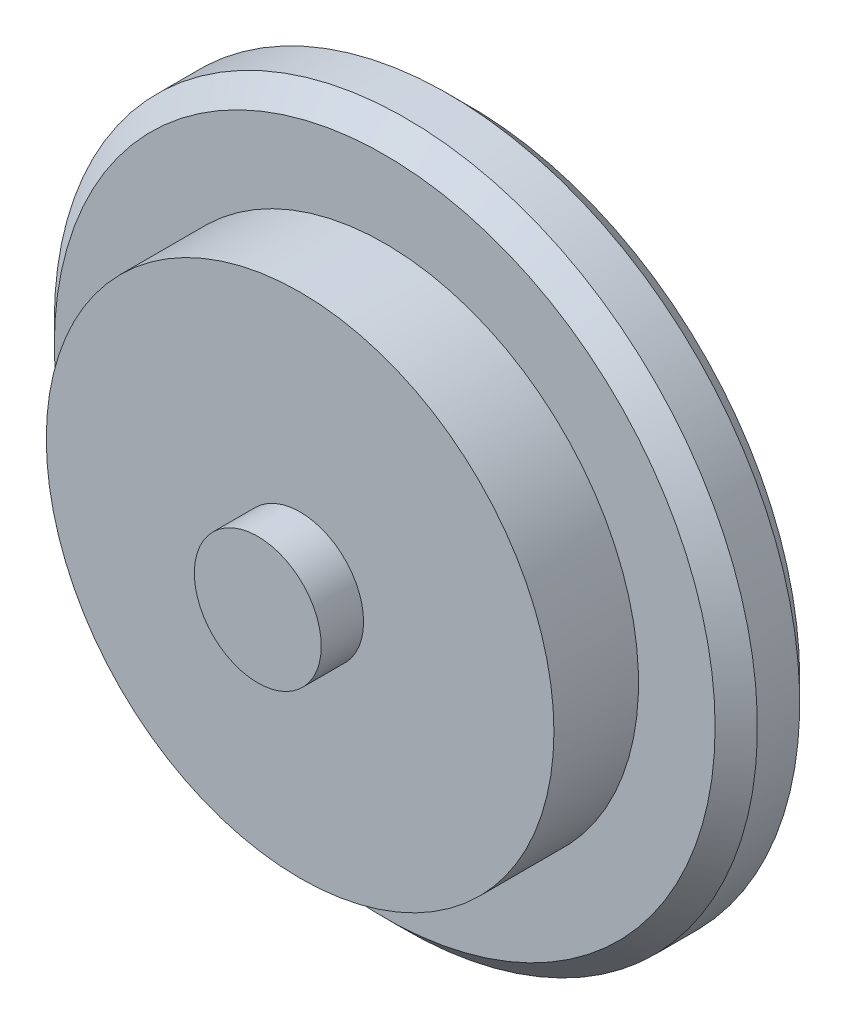
ISO-10303-21;
HEADER;
FILE_DESCRIPTION(('STEP AP214'),'2;1');
FILE_NAME('part.step','',(''),(''),'','','');
FILE_SCHEMA(('AUTOMOTIVE_DESIGN { 1 0 10303 214 1 1 1 1 }'));
ENDSEC;
DATA;
#1=APPLICATION_CONTEXT('core data for automotive mechanical design processes');
#2=APPLICATION_PROTOCOL_DEFINITION('international standard','automotive_design',2000,#1);
#3=PRODUCT_CONTEXT('',#1,'mechanical');
#4=PRODUCT('Part','Part','',(#3));
#5=PRODUCT_RELATED_PRODUCT_CATEGORY('part','',(#4));
#6=PRODUCT_DEFINITION_FORMATION('','',#4);
#7=PRODUCT_DEFINITION_CONTEXT('part definition',#1,'design');
#8=PRODUCT_DEFINITION('design','',#6,#7);
#9=PRODUCT_DEFINITION_SHAPE('','',#8);
#10=(LENGTH_UNIT() NAMED_UNIT(*) SI_UNIT(.MILLI.,.METRE.));
#11=(NAMED_UNIT(*) PLANE_ANGLE_UNIT() SI_UNIT($,.RADIAN.));
#12=(NAMED_UNIT(*) SI_UNIT($,.STERADIAN.) SOLID_ANGLE_UNIT());
#13=UNCERTAINTY_MEASURE_WITH_UNIT(LENGTH_MEASURE(1.E-05),#10,'distance_accuracy_value','');
#14=(GEOMETRIC_REPRESENTATION_CONTEXT(3) GLOBAL_UNCERTAINTY_ASSIGNED_CONTEXT((#13)) GLOBAL_UNIT_ASSIGNED_CONTEXT((#10,
#11,#12)) REPRESENTATION_CONTEXT('',''));
#15=CARTESIAN_POINT('',(0.,0.,0.));
#16=DIRECTION('',(0.,0.,1.));
#17=DIRECTION('',(1.,0.,0.));
#18=AXIS2_PLACEMENT_3D('',#15,#16,#17);
#19=CARTESIAN_POINT('',(0.,0.,25.4));
#20=DIRECTION('',(0.,0.,1.));
#21=DIRECTION('',(1.,0.,0.));
#22=AXIS2_PLACEMENT_3D('',#19,#20,#21);
#23=PLANE('',#22);
#24=CARTESIAN_POINT('',(0.,0.,25.4));
#25=DIRECTION('',(0.,0.,1.));
#26=DIRECTION('',(1.,0.,0.));
#27=AXIS2_PLACEMENT_3D('',#24,#25,#26);
#28=CIRCLE('',#27,76.2);
#29=CARTESIAN_POINT('',(76.2,0.,25.4));
#30=VERTEX_POINT('',#29);
#31=EDGE_CURVE('E51',#30,#30,#28,.T.);
#32=ORIENTED_EDGE('',*,*,#31,.T.);
#33=EDGE_LOOP('',(#32));
#34=FACE_BOUND('',#33,.T.);
#35=CARTESIAN_POINT('',(0.,0.,25.4));
#36=DIRECTION('',(0.,0.,1.));
#37=DIRECTION('',(1.,0.,0.));
#38=AXIS2_PLACEMENT_3D('',#35,#36,#37);
#39=CIRCLE('',#38,19.05);
#40=CARTESIAN_POINT('',(19.05,0.,25.4));
#41=VERTEX_POINT('',#40);
#42=EDGE_CURVE('E55',#41,#41,#39,.T.);
#43=ORIENTED_EDGE('',*,*,#42,.F.);
#44=EDGE_LOOP('',(#43));
#45=FACE_BOUND('',#44,.T.);
#46=ADVANCED_FACE('F31',(#34,#45),#23,.T.);
#47=CARTESIAN_POINT('',(0.,0.,25.4));
#48=DIRECTION('',(0.,0.,-1.));
#49=DIRECTION('',(-1.,0.,0.));
#50=AXIS2_PLACEMENT_3D('',#47,#48,#49);
#51=CYLINDRICAL_SURFACE('',#50,76.2);
#52=ORIENTED_EDGE('',*,*,#31,.F.);
#53=EDGE_LOOP('',(#52));
#54=FACE_BOUND('',#53,.T.);
#55=CARTESIAN_POINT('',(0.,0.,0.));
#56=DIRECTION('',(0.,0.,-1.));
#57=DIRECTION('',(-1.,0.,0.));
#58=AXIS2_PLACEMENT_3D('',#55,#56,#57);
#59=CIRCLE('',#58,76.2);
#60=CARTESIAN_POINT('',(-76.2,0.,0.));
#61=VERTEX_POINT('',#60);
#62=EDGE_CURVE('E58',#61,#61,#59,.T.);
#63=ORIENTED_EDGE('',*,*,#62,.F.);
#64=EDGE_LOOP('',(#63));
#65=FACE_BOUND('',#64,.T.);
#66=ADVANCED_FACE('F111',(#54,#65),#51,.T.);
#67=CARTESIAN_POINT('',(0.,0.,38.1));
#68=DIRECTION('',(0.,0.,-1.));
#69=DIRECTION('',(-1.,0.,0.));
#70=AXIS2_PLACEMENT_3D('',#67,#68,#69);
#71=CYLINDRICAL_SURFACE('',#70,19.05);
#72=CARTESIAN_POINT('',(0.,0.,38.1));
#73=DIRECTION('',(0.,0.,1.));
#74=DIRECTION('',(1.,0.,0.));
#75=AXIS2_PLACEMENT_3D('',#72,#73,#74);
#76=CIRCLE('',#75,19.05);
#77=CARTESIAN_POINT('',(19.05,0.,38.1));
#78=VERTEX_POINT('',#77);
#79=EDGE_CURVE('E54',#78,#78,#76,.T.);
#80=ORIENTED_EDGE('',*,*,#79,.F.);
#81=EDGE_LOOP('',(#80));
#82=FACE_BOUND('',#81,.T.);
#83=ORIENTED_EDGE('',*,*,#42,.T.);
#84=EDGE_LOOP('',(#83));
#85=FACE_BOUND('',#84,.T.);
#86=ADVANCED_FACE('F117',(#82,#85),#71,.T.);
#87=CARTESIAN_POINT('',(0.,0.,38.1));
#88=DIRECTION('',(0.,0.,1.));
#89=DIRECTION('',(1.,0.,0.));
#90=AXIS2_PLACEMENT_3D('',#87,#88,#89);
#91=PLANE('',#90);
#92=ORIENTED_EDGE('',*,*,#79,.T.);
#93=EDGE_LOOP('',(#92));
#94=FACE_BOUND('',#93,.T.);
#95=ADVANCED_FACE('F149',(#94),#91,.T.);
#96=CARTESIAN_POINT('',(0.,0.,0.));
#97=DIRECTION('',(0.,0.,-1.));
#98=DIRECTION('',(-1.,0.,0.));
#99=AXIS2_PLACEMENT_3D('',#96,#97,#98);
#100=PLANE('',#99);
#101=CARTESIAN_POINT('',(0.,0.,0.));
#102=DIRECTION('',(0.,0.,-1.));
#103=DIRECTION('',(-1.,0.,0.));
#104=AXIS2_PLACEMENT_3D('',#101,#102,#103);
#105=CIRCLE('',#104,99.1917009125713);
#106=CARTESIAN_POINT('',(-99.1917009125713,0.,0.));
#107=VERTEX_POINT('',#106);
#108=EDGE_CURVE('E10',#107,#107,#105,.F.);
#109=ORIENTED_EDGE('',*,*,#108,.T.);
#110=EDGE_LOOP('',(#109));
#111=FACE_BOUND('',#110,.T.);
#112=ORIENTED_EDGE('',*,*,#62,.T.);
#113=EDGE_LOOP('',(#112));
#114=FACE_BOUND('',#113,.T.);
#115=ADVANCED_FACE('F141',(#111,#114),#100,.F.);
#116=CARTESIAN_POINT('',(0.,0.,-25.4));
#117=DIRECTION('',(0.,0.,1.));
#118=DIRECTION('',(1.,0.,0.));
#119=AXIS2_PLACEMENT_3D('',#116,#117,#118);
#120=CYLINDRICAL_SURFACE('',#119,105.541700912571);
#121=CARTESIAN_POINT('',(0.,0.,-19.05));
#122=DIRECTION('',(0.,0.,-1.));
#123=DIRECTION('',(-1.,0.,0.));
#124=AXIS2_PLACEMENT_3D('',#121,#122,#123);
#125=CIRCLE('',#124,105.541700912571);
#126=CARTESIAN_POINT('',(-105.541700912571,0.,-19.05));
#127=VERTEX_POINT('',#126);
#128=EDGE_CURVE('E38',#127,#127,#125,.F.);
#129=ORIENTED_EDGE('',*,*,#128,.T.);
#130=EDGE_LOOP('',(#129));
#131=FACE_BOUND('',#130,.T.);
#132=CARTESIAN_POINT('',(0.,0.,-6.35000000000004));
#133=DIRECTION('',(0.,0.,-1.));
#134=DIRECTION('',(-1.,0.,0.));
#135=AXIS2_PLACEMENT_3D('',#132,#133,#134);
#136=CIRCLE('',#135,105.541700912571);
#137=CARTESIAN_POINT('',(-105.541700912571,0.,-6.35000000000004));
#138=VERTEX_POINT('',#137);
#139=EDGE_CURVE('E42',#138,#138,#136,.T.);
#140=ORIENTED_EDGE('',*,*,#139,.T.);
#141=EDGE_LOOP('',(#140));
#142=FACE_BOUND('',#141,.T.);
#143=ADVANCED_FACE('F132',(#131,#142),#120,.T.);
#144=CARTESIAN_POINT('',(0.,0.,-25.4));
#145=DIRECTION('',(0.,0.,-1.));
#146=DIRECTION('',(-1.,0.,0.));
#147=AXIS2_PLACEMENT_3D('',#144,#145,#146);
#148=PLANE('',#147);
#149=CARTESIAN_POINT('',(0.,0.,-25.4));
#150=DIRECTION('',(0.,0.,-1.));
#151=DIRECTION('',(-1.,0.,0.));
#152=AXIS2_PLACEMENT_3D('',#149,#150,#151);
#153=CIRCLE('',#152,98.2936753004644);
#154=CARTESIAN_POINT('',(-98.2936753004644,0.,-25.4));
#155=VERTEX_POINT('',#154);
#156=EDGE_CURVE('E64',#155,#155,#153,.T.);
#157=ORIENTED_EDGE('',*,*,#156,.F.);
#158=EDGE_LOOP('',(#157));
#159=FACE_BOUND('',#158,.T.);
#160=CARTESIAN_POINT('',(0.,0.,-25.4));
#161=DIRECTION('',(0.,0.,-1.));
#162=DIRECTION('',(-1.,0.,0.));
#163=AXIS2_PLACEMENT_3D('',#160,#161,#162);
#164=CIRCLE('',#163,99.1917009125714);
#165=CARTESIAN_POINT('',(-99.1917009125714,0.,-25.4));
#166=VERTEX_POINT('',#165);
#167=EDGE_CURVE('E46',#166,#166,#164,.T.);
#168=ORIENTED_EDGE('',*,*,#167,.T.);
#169=EDGE_LOOP('',(#168));
#170=FACE_BOUND('',#169,.T.);
#171=ADVANCED_FACE('F125',(#159,#170),#148,.T.);
#172=CARTESIAN_POINT('',(0.,0.,-25.4));
#173=DIRECTION('',(0.,0.,1.));
#174=DIRECTION('',(1.,0.,0.));
#175=AXIS2_PLACEMENT_3D('',#172,#173,#174);
#176=CONICAL_SURFACE('',#175,99.1917009125714,0.785398163397447);
#177=ORIENTED_EDGE('',*,*,#128,.F.);
#178=EDGE_LOOP('',(#177));
#179=FACE_BOUND('',#178,.T.);
#180=ORIENTED_EDGE('',*,*,#167,.F.);
#181=EDGE_LOOP('',(#180));
#182=FACE_BOUND('',#181,.T.);
#183=ADVANCED_FACE('F123',(#179,#182),#176,.T.);
#184=CARTESIAN_POINT('',(0.,0.,-6.35000000000004));
#185=DIRECTION('',(0.,0.,-1.));
#186=DIRECTION('',(-1.,0.,0.));
#187=AXIS2_PLACEMENT_3D('',#184,#185,#186);
#188=CONICAL_SURFACE('',#187,105.541700912571,0.78539816339745);
#189=ORIENTED_EDGE('',*,*,#108,.F.);
#190=EDGE_LOOP('',(#189));
#191=FACE_BOUND('',#190,.T.);
#192=ORIENTED_EDGE('',*,*,#139,.F.);
#193=EDGE_LOOP('',(#192));
#194=FACE_BOUND('',#193,.T.);
#195=ADVANCED_FACE('F33',(#191,#194),#188,.T.);
#196=CARTESIAN_POINT('',(0.,0.,24.765));
#197=DIRECTION('',(0.,0.,1.));
#198=DIRECTION('',(1.,0.,0.));
#199=AXIS2_PLACEMENT_3D('',#196,#197,#198);
#200=PLANE('',#199);
#201=CARTESIAN_POINT('',(0.,0.,24.765));
#202=DIRECTION('',(0.,0.,1.));
#203=DIRECTION('',(1.,0.,0.));
#204=AXIS2_PLACEMENT_3D('',#201,#202,#203);
#205=CIRCLE('',#204,75.565);
#206=CARTESIAN_POINT('',(75.565,0.,24.765));
#207=VERTEX_POINT('',#206);
#208=EDGE_CURVE('E68',#207,#207,#205,.T.);
#209=ORIENTED_EDGE('',*,*,#208,.F.);
#210=EDGE_LOOP('',(#209));
#211=FACE_BOUND('',#210,.T.);
#212=CARTESIAN_POINT('',(0.,0.,24.765));
#213=DIRECTION('',(0.,0.,1.));
#214=DIRECTION('',(1.,0.,0.));
#215=AXIS2_PLACEMENT_3D('',#212,#213,#214);
#216=CIRCLE('',#215,18.415);
#217=CARTESIAN_POINT('',(18.415,0.,24.765));
#218=VERTEX_POINT('',#217);
#219=EDGE_CURVE('E72',#218,#218,#216,.T.);
#220=ORIENTED_EDGE('',*,*,#219,.T.);
#221=EDGE_LOOP('',(#220));
#222=FACE_BOUND('',#221,.T.);
#223=ADVANCED_FACE('F91',(#211,#222),#200,.F.);
#224=CARTESIAN_POINT('',(0.,0.,25.4));
#225=DIRECTION('',(0.,0.,-1.));
#226=DIRECTION('',(-1.,0.,0.));
#227=AXIS2_PLACEMENT_3D('',#224,#225,#226);
#228=CYLINDRICAL_SURFACE('',#227,75.565);
#229=ORIENTED_EDGE('',*,*,#208,.T.);
#230=EDGE_LOOP('',(#229));
#231=FACE_BOUND('',#230,.T.);
#232=CARTESIAN_POINT('',(0.,0.,-0.635));
#233=DIRECTION('',(0.,0.,-1.));
#234=DIRECTION('',(-1.,0.,0.));
#235=AXIS2_PLACEMENT_3D('',#232,#233,#234);
#236=CIRCLE('',#235,75.565);
#237=CARTESIAN_POINT('',(-75.565,0.,-0.635));
#238=VERTEX_POINT('',#237);
#239=EDGE_CURVE('E80',#238,#238,#236,.T.);
#240=ORIENTED_EDGE('',*,*,#239,.T.);
#241=EDGE_LOOP('',(#240));
#242=FACE_BOUND('',#241,.T.);
#243=ADVANCED_FACE('F88',(#231,#242),#228,.F.);
#244=CARTESIAN_POINT('',(0.,0.,38.1));
#245=DIRECTION('',(0.,0.,-1.));
#246=DIRECTION('',(-1.,0.,0.));
#247=AXIS2_PLACEMENT_3D('',#244,#245,#246);
#248=CYLINDRICAL_SURFACE('',#247,18.415);
#249=CARTESIAN_POINT('',(0.,0.,37.465));
#250=DIRECTION('',(0.,0.,1.));
#251=DIRECTION('',(1.,0.,0.));
#252=AXIS2_PLACEMENT_3D('',#249,#250,#251);
#253=CIRCLE('',#252,18.415);
#254=CARTESIAN_POINT('',(18.415,0.,37.465));
#255=VERTEX_POINT('',#254);
#256=EDGE_CURVE('E69',#255,#255,#253,.T.);
#257=ORIENTED_EDGE('',*,*,#256,.T.);
#258=EDGE_LOOP('',(#257));
#259=FACE_BOUND('',#258,.T.);
#260=ORIENTED_EDGE('',*,*,#219,.F.);
#261=EDGE_LOOP('',(#260));
#262=FACE_BOUND('',#261,.T.);
#263=ADVANCED_FACE('F97',(#259,#262),#248,.F.);
#264=CARTESIAN_POINT('',(0.,0.,37.465));
#265=DIRECTION('',(0.,0.,1.));
#266=DIRECTION('',(1.,0.,0.));
#267=AXIS2_PLACEMENT_3D('',#264,#265,#266);
#268=PLANE('',#267);
#269=ORIENTED_EDGE('',*,*,#256,.F.);
#270=EDGE_LOOP('',(#269));
#271=FACE_BOUND('',#270,.T.);
#272=ADVANCED_FACE('F99',(#271),#268,.F.);
#273=CARTESIAN_POINT('',(0.,0.,-0.635));
#274=DIRECTION('',(0.,0.,-1.));
#275=DIRECTION('',(-1.,0.,0.));
#276=AXIS2_PLACEMENT_3D('',#273,#274,#275);
#277=PLANE('',#276);
#278=CARTESIAN_POINT('',(0.,0.,-0.635));
#279=DIRECTION('',(0.,0.,-1.));
#280=DIRECTION('',(-1.,0.,0.));
#281=AXIS2_PLACEMENT_3D('',#278,#279,#280);
#282=CIRCLE('',#281,98.9286753004644);
#283=CARTESIAN_POINT('',(-98.9286753004644,0.,-0.635));
#284=VERTEX_POINT('',#283);
#285=EDGE_CURVE('E63',#284,#284,#282,.F.);
#286=ORIENTED_EDGE('',*,*,#285,.F.);
#287=EDGE_LOOP('',(#286));
#288=FACE_BOUND('',#287,.T.);
#289=ORIENTED_EDGE('',*,*,#239,.F.);
#290=EDGE_LOOP('',(#289));
#291=FACE_BOUND('',#290,.T.);
#292=ADVANCED_FACE('F106',(#288,#291),#277,.T.);
#293=CARTESIAN_POINT('',(0.,0.,-25.4));
#294=DIRECTION('',(0.,0.,1.));
#295=DIRECTION('',(1.,0.,0.));
#296=AXIS2_PLACEMENT_3D('',#293,#294,#295);
#297=CYLINDRICAL_SURFACE('',#296,104.906700912571);
#298=CARTESIAN_POINT('',(0.,0.,-18.7869743878931));
#299=DIRECTION('',(0.,0.,1.));
#300=DIRECTION('',(1.,0.,0.));
#301=AXIS2_PLACEMENT_3D('',#298,#299,#300);
#302=CIRCLE('',#301,104.906700912571);
#303=CARTESIAN_POINT('',(104.906700912571,0.,-18.7869743878931));
#304=VERTEX_POINT('',#303);
#305=EDGE_CURVE('E73',#304,#304,#302,.T.);
#306=ORIENTED_EDGE('',*,*,#305,.F.);
#307=EDGE_LOOP('',(#306));
#308=FACE_BOUND('',#307,.T.);
#309=CARTESIAN_POINT('',(0.,0.,-6.61302561210696));
#310=DIRECTION('',(0.,0.,-1.));
#311=DIRECTION('',(-1.,0.,0.));
#312=AXIS2_PLACEMENT_3D('',#309,#310,#311);
#313=CIRCLE('',#312,104.906700912571);
#314=CARTESIAN_POINT('',(-104.906700912571,0.,-6.61302561210696));
#315=VERTEX_POINT('',#314);
#316=EDGE_CURVE('E67',#315,#315,#313,.T.);
#317=ORIENTED_EDGE('',*,*,#316,.F.);
#318=EDGE_LOOP('',(#317));
#319=FACE_BOUND('',#318,.T.);
#320=ADVANCED_FACE('F227',(#308,#319),#297,.F.);
#321=CARTESIAN_POINT('',(0.,0.,-24.9509871939465));
#322=DIRECTION('',(0.,0.,1.));
#323=DIRECTION('',(1.,0.,0.));
#324=AXIS2_PLACEMENT_3D('',#321,#322,#323);
#325=CONICAL_SURFACE('',#324,98.7426881065179,0.785398163397447);
#326=ORIENTED_EDGE('',*,*,#305,.T.);
#327=EDGE_LOOP('',(#326));
#328=FACE_BOUND('',#327,.T.);
#329=ORIENTED_EDGE('',*,*,#156,.T.);
#330=EDGE_LOOP('',(#329));
#331=FACE_BOUND('',#330,.T.);
#332=ADVANCED_FACE('F236',(#328,#331),#325,.F.);
#333=CARTESIAN_POINT('',(0.,0.,-6.7990128060535));
#334=DIRECTION('',(0.,0.,-1.));
#335=DIRECTION('',(-1.,0.,0.));
#336=AXIS2_PLACEMENT_3D('',#333,#334,#335);
#337=CONICAL_SURFACE('',#336,105.092688106518,0.78539816339745);
#338=ORIENTED_EDGE('',*,*,#285,.T.);
#339=EDGE_LOOP('',(#338));
#340=FACE_BOUND('',#339,.T.);
#341=ORIENTED_EDGE('',*,*,#316,.T.);
#342=EDGE_LOOP('',(#341));
#343=FACE_BOUND('',#342,.T.);
#344=ADVANCED_FACE('F146',(#340,#343),#337,.F.);
#345=CLOSED_SHELL('',(#46,#66,#86,#95,#115,#143,#171,#183,#195,#223,#243,#263,#272,#292,#320,
#332,#344));
#346=MANIFOLD_SOLID_BREP('B2',#345);
#347=ADVANCED_BREP_SHAPE_REPRESENTATION('',(#18,#346),#14);
#348=SHAPE_DEFINITION_REPRESENTATION(#9,#347);
ENDSEC;
END-ISO-10303-21;
